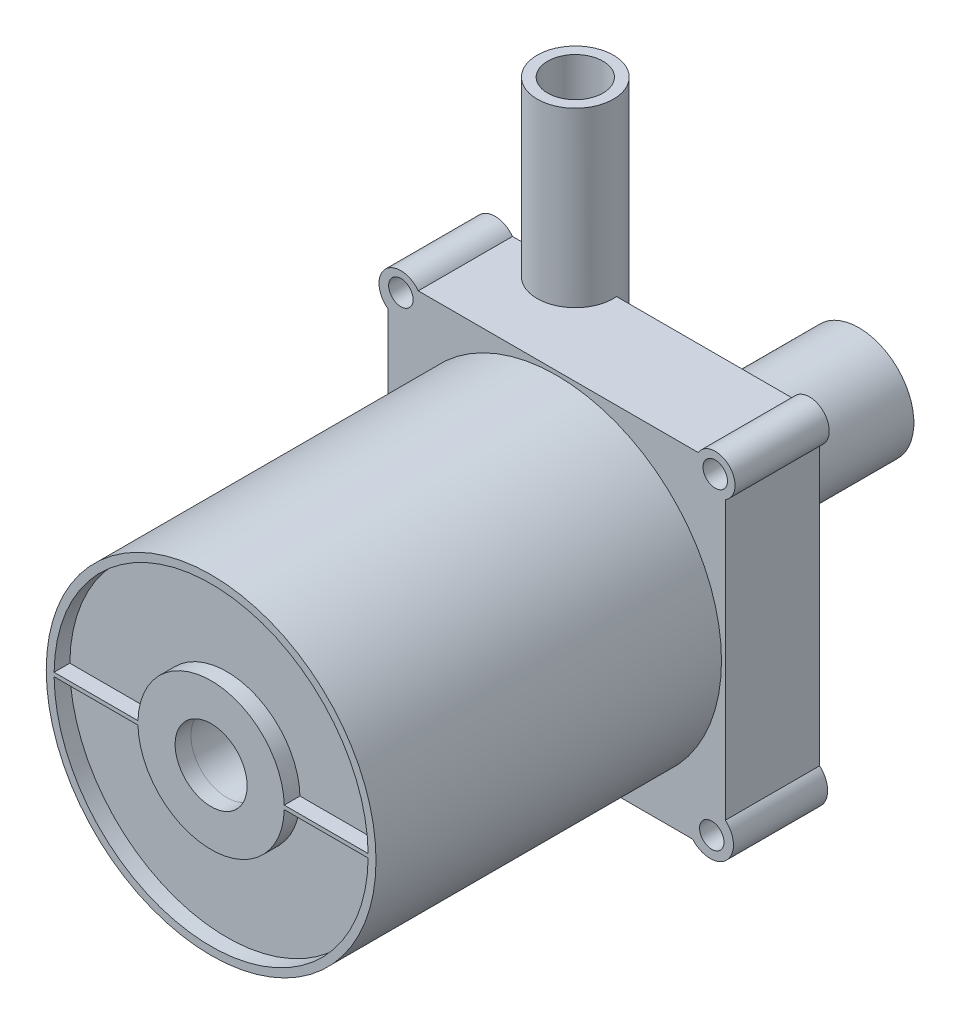
ISO-10303-21;
HEADER;
FILE_DESCRIPTION(('STEP AP214'),'2;1');
FILE_NAME('part.step','',(''),(''),'','','');
FILE_SCHEMA(('AUTOMOTIVE_DESIGN { 1 0 10303 214 1 1 1 1 }'));
ENDSEC;
DATA;
#1=APPLICATION_CONTEXT('core data for automotive mechanical design processes');
#2=APPLICATION_PROTOCOL_DEFINITION('international standard','automotive_design',2000,#1);
#3=PRODUCT_CONTEXT('',#1,'mechanical');
#4=PRODUCT('Part','Part','',(#3));
#5=PRODUCT_RELATED_PRODUCT_CATEGORY('part','',(#4));
#6=PRODUCT_DEFINITION_FORMATION('','',#4);
#7=PRODUCT_DEFINITION_CONTEXT('part definition',#1,'design');
#8=PRODUCT_DEFINITION('design','',#6,#7);
#9=PRODUCT_DEFINITION_SHAPE('','',#8);
#10=(LENGTH_UNIT() NAMED_UNIT(*) SI_UNIT(.MILLI.,.METRE.));
#11=(NAMED_UNIT(*) PLANE_ANGLE_UNIT() SI_UNIT($,.RADIAN.));
#12=(NAMED_UNIT(*) SI_UNIT($,.STERADIAN.) SOLID_ANGLE_UNIT());
#13=UNCERTAINTY_MEASURE_WITH_UNIT(LENGTH_MEASURE(1.E-05),#10,'distance_accuracy_value','');
#14=(GEOMETRIC_REPRESENTATION_CONTEXT(3) GLOBAL_UNCERTAINTY_ASSIGNED_CONTEXT((#13)) GLOBAL_UNIT_ASSIGNED_CONTEXT((#10,
#11,#12)) REPRESENTATION_CONTEXT('',''));
#15=CARTESIAN_POINT('',(0.,0.,0.));
#16=DIRECTION('',(0.,0.,1.));
#17=DIRECTION('',(1.,0.,0.));
#18=AXIS2_PLACEMENT_3D('',#15,#16,#17);
#19=CARTESIAN_POINT('',(-20.4985321115025,0.245318718606832,44.));
#20=DIRECTION('',(0.,-1.,0.));
#21=DIRECTION('',(0.,0.,-1.));
#22=AXIS2_PLACEMENT_3D('',#19,#20,#21);
#23=PLANE('',#22);
#24=DIRECTION('',(0.,0.,-1.));
#25=VECTOR('',#24,1.);
#26=CARTESIAN_POINT('',(-9.31614607403352,0.245318718606832,44.));
#27=LINE('',#26,#25);
#28=CARTESIAN_POINT('',(-9.31614607403352,0.245318718606832,42.));
#29=VERTEX_POINT('',#28);
#30=CARTESIAN_POINT('',(-9.31614607403352,0.245318718606832,44.));
#31=VERTEX_POINT('',#30);
#32=EDGE_CURVE('E315',#29,#31,#27,.F.);
#33=ORIENTED_EDGE('',*,*,#32,.F.);
#34=DIRECTION('',(-1.,0.,0.));
#35=VECTOR('',#34,1.);
#36=CARTESIAN_POINT('',(-20.4985321115025,0.245318718606832,42.));
#37=LINE('',#36,#35);
#38=CARTESIAN_POINT('',(-19.9984954115629,0.245318718606832,42.));
#39=VERTEX_POINT('',#38);
#40=EDGE_CURVE('E323',#29,#39,#37,.T.);
#41=ORIENTED_EDGE('',*,*,#40,.T.);
#42=DIRECTION('',(0.,0.,1.));
#43=VECTOR('',#42,1.);
#44=CARTESIAN_POINT('',(-19.9984954115629,0.245318718606832,42.));
#45=LINE('',#44,#43);
#46=CARTESIAN_POINT('',(-19.9984954115629,0.245318718606832,44.));
#47=VERTEX_POINT('',#46);
#48=EDGE_CURVE('E979',#39,#47,#45,.T.);
#49=ORIENTED_EDGE('',*,*,#48,.T.);
#50=DIRECTION('',(-1.,0.,0.));
#51=VECTOR('',#50,1.);
#52=CARTESIAN_POINT('',(-20.4985321115025,0.245318718606832,44.));
#53=LINE('',#52,#51);
#54=EDGE_CURVE('E985',#31,#47,#53,.T.);
#55=ORIENTED_EDGE('',*,*,#54,.F.);
#56=EDGE_LOOP('',(#33,#41,#49,#55));
#57=FACE_BOUND('',#56,.T.);
#58=ADVANCED_FACE('F184',(#57),#23,.F.);
#59=DIRECTION('',(0.,0.,-1.));
#60=VECTOR('',#59,1.);
#61=CARTESIAN_POINT('',(9.31614607403352,0.245318718606832,44.));
#62=LINE('',#61,#60);
#63=CARTESIAN_POINT('',(9.31614607403352,0.245318718606832,44.));
#64=VERTEX_POINT('',#63);
#65=CARTESIAN_POINT('',(9.31614607403352,0.245318718606832,42.));
#66=VERTEX_POINT('',#65);
#67=EDGE_CURVE('E307',#64,#66,#62,.T.);
#68=ORIENTED_EDGE('',*,*,#67,.F.);
#69=CARTESIAN_POINT('',(19.9984954115629,0.245318718606832,44.));
#70=VERTEX_POINT('',#69);
#71=EDGE_CURVE('E983',#70,#64,#53,.T.);
#72=ORIENTED_EDGE('',*,*,#71,.F.);
#73=DIRECTION('',(0.,0.,1.));
#74=VECTOR('',#73,1.);
#75=CARTESIAN_POINT('',(19.9984954115629,0.245318718606832,42.));
#76=LINE('',#75,#74);
#77=CARTESIAN_POINT('',(19.9984954115629,0.245318718606832,42.));
#78=VERTEX_POINT('',#77);
#79=EDGE_CURVE('E329',#70,#78,#76,.F.);
#80=ORIENTED_EDGE('',*,*,#79,.T.);
#81=EDGE_CURVE('E321',#78,#66,#37,.T.);
#82=ORIENTED_EDGE('',*,*,#81,.T.);
#83=EDGE_LOOP('',(#68,#72,#80,#82));
#84=FACE_BOUND('',#83,.T.);
#85=ADVANCED_FACE('F327',(#84),#23,.F.);
#86=CARTESIAN_POINT('',(-20.4985321115025,-0.245318718606832,44.));
#87=DIRECTION('',(0.,1.,0.));
#88=DIRECTION('',(0.,0.,1.));
#89=AXIS2_PLACEMENT_3D('',#86,#87,#88);
#90=PLANE('',#89);
#91=DIRECTION('',(0.,0.,-1.));
#92=VECTOR('',#91,1.);
#93=CARTESIAN_POINT('',(9.31614607403352,-0.245318718606832,44.));
#94=LINE('',#93,#92);
#95=CARTESIAN_POINT('',(9.31614607403352,-0.245318718606832,42.));
#96=VERTEX_POINT('',#95);
#97=CARTESIAN_POINT('',(9.31614607403351,-0.245318718606832,44.));
#98=VERTEX_POINT('',#97);
#99=EDGE_CURVE('E12',#96,#98,#94,.F.);
#100=ORIENTED_EDGE('',*,*,#99,.F.);
#101=DIRECTION('',(1.,0.,0.));
#102=VECTOR('',#101,1.);
#103=CARTESIAN_POINT('',(-20.4985321115025,-0.245318718606832,42.));
#104=LINE('',#103,#102);
#105=CARTESIAN_POINT('',(19.9984954115629,-0.245318718606832,42.));
#106=VERTEX_POINT('',#105);
#107=EDGE_CURVE('E330',#96,#106,#104,.T.);
#108=ORIENTED_EDGE('',*,*,#107,.T.);
#109=DIRECTION('',(0.,0.,1.));
#110=VECTOR('',#109,1.);
#111=CARTESIAN_POINT('',(19.9984954115629,-0.245318718606832,42.));
#112=LINE('',#111,#110);
#113=CARTESIAN_POINT('',(19.9984954115629,-0.245318718606832,44.));
#114=VERTEX_POINT('',#113);
#115=EDGE_CURVE('E362',#106,#114,#112,.T.);
#116=ORIENTED_EDGE('',*,*,#115,.T.);
#117=DIRECTION('',(1.,0.,0.));
#118=VECTOR('',#117,1.);
#119=CARTESIAN_POINT('',(-20.4985321115025,-0.245318718606832,44.));
#120=LINE('',#119,#118);
#121=EDGE_CURVE('E982',#98,#114,#120,.T.);
#122=ORIENTED_EDGE('',*,*,#121,.F.);
#123=EDGE_LOOP('',(#100,#108,#116,#122));
#124=FACE_BOUND('',#123,.T.);
#125=ADVANCED_FACE('F514',(#124),#90,.F.);
#126=DIRECTION('',(0.,0.,-1.));
#127=VECTOR('',#126,1.);
#128=CARTESIAN_POINT('',(-9.31614607403352,-0.245318718606832,44.));
#129=LINE('',#128,#127);
#130=CARTESIAN_POINT('',(-9.31614607403352,-0.245318718606832,44.));
#131=VERTEX_POINT('',#130);
#132=CARTESIAN_POINT('',(-9.31614607403352,-0.245318718606832,42.));
#133=VERTEX_POINT('',#132);
#134=EDGE_CURVE('E192',#131,#133,#129,.T.);
#135=ORIENTED_EDGE('',*,*,#134,.F.);
#136=CARTESIAN_POINT('',(-19.9984954115629,-0.245318718606832,44.));
#137=VERTEX_POINT('',#136);
#138=EDGE_CURVE('E335',#137,#131,#120,.T.);
#139=ORIENTED_EDGE('',*,*,#138,.F.);
#140=DIRECTION('',(0.,0.,1.));
#141=VECTOR('',#140,1.);
#142=CARTESIAN_POINT('',(-19.9984954115629,-0.245318718606832,42.));
#143=LINE('',#142,#141);
#144=CARTESIAN_POINT('',(-19.9984954115629,-0.245318718606832,42.));
#145=VERTEX_POINT('',#144);
#146=EDGE_CURVE('E973',#137,#145,#143,.F.);
#147=ORIENTED_EDGE('',*,*,#146,.T.);
#148=EDGE_CURVE('E332',#145,#133,#104,.T.);
#149=ORIENTED_EDGE('',*,*,#148,.T.);
#150=EDGE_LOOP('',(#135,#139,#147,#149));
#151=FACE_BOUND('',#150,.T.);
#152=ADVANCED_FACE('F521',(#151),#90,.F.);
#153=CARTESIAN_POINT('',(0.,0.,42.));
#154=DIRECTION('',(0.,0.,1.));
#155=DIRECTION('',(1.,0.,0.));
#156=AXIS2_PLACEMENT_3D('',#153,#154,#155);
#157=PLANE('',#156);
#158=ORIENTED_EDGE('',*,*,#40,.F.);
#159=CARTESIAN_POINT('',(0.,0.,42.));
#160=DIRECTION('',(0.,0.,1.));
#161=DIRECTION('',(1.,0.,0.));
#162=AXIS2_PLACEMENT_3D('',#159,#160,#161);
#163=CIRCLE('',#162,9.31937545903313);
#164=EDGE_CURVE('E310',#66,#29,#163,.T.);
#165=ORIENTED_EDGE('',*,*,#164,.F.);
#166=ORIENTED_EDGE('',*,*,#81,.F.);
#167=CARTESIAN_POINT('',(0.,0.,42.));
#168=DIRECTION('',(0.,0.,1.));
#169=DIRECTION('',(1.,0.,0.));
#170=AXIS2_PLACEMENT_3D('',#167,#168,#169);
#171=CIRCLE('',#170,20.);
#172=EDGE_CURVE('E338',#78,#39,#171,.T.);
#173=ORIENTED_EDGE('',*,*,#172,.T.);
#174=EDGE_LOOP('',(#158,#165,#166,#173));
#175=FACE_BOUND('',#174,.T.);
#176=ADVANCED_FACE('F319',(#175),#157,.T.);
#177=ORIENTED_EDGE('',*,*,#107,.F.);
#178=EDGE_CURVE('E324',#133,#96,#163,.T.);
#179=ORIENTED_EDGE('',*,*,#178,.F.);
#180=ORIENTED_EDGE('',*,*,#148,.F.);
#181=EDGE_CURVE('E341',#145,#106,#171,.T.);
#182=ORIENTED_EDGE('',*,*,#181,.T.);
#183=EDGE_LOOP('',(#177,#179,#180,#182));
#184=FACE_BOUND('',#183,.T.);
#185=ADVANCED_FACE('F520',(#184),#157,.T.);
#186=CARTESIAN_POINT('',(0.,0.,42.));
#187=DIRECTION('',(0.,0.,1.));
#188=DIRECTION('',(1.,0.,0.));
#189=AXIS2_PLACEMENT_3D('',#186,#187,#188);
#190=CYLINDRICAL_SURFACE('',#189,20.);
#191=ORIENTED_EDGE('',*,*,#79,.F.);
#192=CARTESIAN_POINT('',(0.,0.,44.));
#193=DIRECTION('',(0.,0.,1.));
#194=DIRECTION('',(1.,0.,0.));
#195=AXIS2_PLACEMENT_3D('',#192,#193,#194);
#196=CIRCLE('',#195,20.);
#197=EDGE_CURVE('E342',#70,#47,#196,.T.);
#198=ORIENTED_EDGE('',*,*,#197,.T.);
#199=ORIENTED_EDGE('',*,*,#48,.F.);
#200=ORIENTED_EDGE('',*,*,#172,.F.);
#201=EDGE_LOOP('',(#191,#198,#199,#200));
#202=FACE_BOUND('',#201,.T.);
#203=ADVANCED_FACE('F522',(#202),#190,.F.);
#204=ORIENTED_EDGE('',*,*,#146,.F.);
#205=EDGE_CURVE('E345',#137,#114,#196,.T.);
#206=ORIENTED_EDGE('',*,*,#205,.T.);
#207=ORIENTED_EDGE('',*,*,#115,.F.);
#208=ORIENTED_EDGE('',*,*,#181,.F.);
#209=EDGE_LOOP('',(#204,#206,#207,#208));
#210=FACE_BOUND('',#209,.T.);
#211=ADVANCED_FACE('F525',(#210),#190,.F.);
#212=CARTESIAN_POINT('',(0.,0.,81.5));
#213=DIRECTION('',(0.,0.,-1.));
#214=DIRECTION('',(-1.,0.,0.));
#215=AXIS2_PLACEMENT_3D('',#212,#213,#214);
#216=CYLINDRICAL_SURFACE('',#215,4.67050692238864);
#217=CARTESIAN_POINT('',(0.,0.,-38.5));
#218=DIRECTION('',(0.,0.,-1.));
#219=DIRECTION('',(-1.,0.,0.));
#220=AXIS2_PLACEMENT_3D('',#217,#218,#219);
#221=CIRCLE('',#220,4.67050692238864);
#222=CARTESIAN_POINT('',(-4.67050692238864,0.,-38.5));
#223=VERTEX_POINT('',#222);
#224=EDGE_CURVE('E349',#223,#223,#221,.T.);
#225=ORIENTED_EDGE('',*,*,#224,.T.);
#226=EDGE_LOOP('',(#225));
#227=FACE_BOUND('',#226,.T.);
#228=CARTESIAN_POINT('',(0.,0.,42.));
#229=DIRECTION('',(0.,0.,1.));
#230=DIRECTION('',(1.,0.,0.));
#231=AXIS2_PLACEMENT_3D('',#228,#229,#230);
#232=CIRCLE('',#231,4.67050692238864);
#233=CARTESIAN_POINT('',(4.67050692238864,0.,42.));
#234=VERTEX_POINT('',#233);
#235=EDGE_CURVE('E340',#234,#234,#232,.F.);
#236=ORIENTED_EDGE('',*,*,#235,.F.);
#237=EDGE_LOOP('',(#236));
#238=FACE_BOUND('',#237,.T.);
#239=ADVANCED_FACE('F537',(#227,#238),#216,.F.);
#240=CARTESIAN_POINT('',(0.,0.,44.));
#241=DIRECTION('',(0.,0.,-1.));
#242=DIRECTION('',(-1.,0.,0.));
#243=AXIS2_PLACEMENT_3D('',#240,#241,#242);
#244=CYLINDRICAL_SURFACE('',#243,21.);
#245=CARTESIAN_POINT('',(0.,0.,44.));
#246=DIRECTION('',(0.,0.,1.));
#247=DIRECTION('',(1.,0.,0.));
#248=AXIS2_PLACEMENT_3D('',#245,#246,#247);
#249=CIRCLE('',#248,21.);
#250=CARTESIAN_POINT('',(21.,0.,44.));
#251=VERTEX_POINT('',#250);
#252=EDGE_CURVE('E474',#251,#251,#249,.T.);
#253=ORIENTED_EDGE('',*,*,#252,.F.);
#254=EDGE_LOOP('',(#253));
#255=FACE_BOUND('',#254,.T.);
#256=CARTESIAN_POINT('',(0.,0.,0.));
#257=DIRECTION('',(0.,0.,1.));
#258=DIRECTION('',(1.,0.,0.));
#259=AXIS2_PLACEMENT_3D('',#256,#257,#258);
#260=CIRCLE('',#259,21.);
#261=CARTESIAN_POINT('',(21.,0.,0.));
#262=VERTEX_POINT('',#261);
#263=EDGE_CURVE('E472',#262,#262,#260,.T.);
#264=ORIENTED_EDGE('',*,*,#263,.T.);
#265=EDGE_LOOP('',(#264));
#266=FACE_BOUND('',#265,.T.);
#267=ADVANCED_FACE('F186',(#255,#266),#244,.T.);
#268=CARTESIAN_POINT('',(0.,0.,44.));
#269=DIRECTION('',(0.,0.,1.));
#270=DIRECTION('',(1.,0.,0.));
#271=AXIS2_PLACEMENT_3D('',#268,#269,#270);
#272=PLANE('',#271);
#273=CARTESIAN_POINT('',(0.,0.,44.));
#274=DIRECTION('',(0.,0.,1.));
#275=DIRECTION('',(1.,0.,0.));
#276=AXIS2_PLACEMENT_3D('',#273,#274,#275);
#277=CIRCLE('',#276,4.58231075628868);
#278=CARTESIAN_POINT('',(4.58231075628868,0.,44.));
#279=VERTEX_POINT('',#278);
#280=EDGE_CURVE('E989',#279,#279,#277,.T.);
#281=ORIENTED_EDGE('',*,*,#280,.F.);
#282=EDGE_LOOP('',(#281));
#283=FACE_BOUND('',#282,.T.);
#284=CARTESIAN_POINT('',(0.,0.,44.));
#285=DIRECTION('',(0.,0.,1.));
#286=DIRECTION('',(1.,0.,0.));
#287=AXIS2_PLACEMENT_3D('',#284,#285,#286);
#288=CIRCLE('',#287,9.31937545903313);
#289=EDGE_CURVE('E199',#64,#31,#288,.T.);
#290=ORIENTED_EDGE('',*,*,#289,.T.);
#291=ORIENTED_EDGE('',*,*,#54,.T.);
#292=ORIENTED_EDGE('',*,*,#197,.F.);
#293=ORIENTED_EDGE('',*,*,#71,.T.);
#294=EDGE_LOOP('',(#290,#291,#292,#293));
#295=FACE_BOUND('',#294,.T.);
#296=ORIENTED_EDGE('',*,*,#138,.T.);
#297=EDGE_CURVE('E207',#131,#98,#288,.T.);
#298=ORIENTED_EDGE('',*,*,#297,.T.);
#299=ORIENTED_EDGE('',*,*,#121,.T.);
#300=ORIENTED_EDGE('',*,*,#205,.F.);
#301=EDGE_LOOP('',(#296,#298,#299,#300));
#302=FACE_BOUND('',#301,.T.);
#303=ORIENTED_EDGE('',*,*,#252,.T.);
#304=EDGE_LOOP('',(#303));
#305=FACE_BOUND('',#304,.T.);
#306=ADVANCED_FACE('F658',(#283,#295,#302,#305),#272,.T.);
#307=CARTESIAN_POINT('',(0.,0.,0.));
#308=DIRECTION('',(0.,0.,-1.));
#309=DIRECTION('',(-1.,0.,0.));
#310=AXIS2_PLACEMENT_3D('',#307,#308,#309);
#311=PLANE('',#310);
#312=CARTESIAN_POINT('',(19.7620983400342,-19.8463660631883,0.));
#313=DIRECTION('',(0.,0.,-1.));
#314=DIRECTION('',(-1.,0.,0.));
#315=AXIS2_PLACEMENT_3D('',#312,#313,#314);
#316=CIRCLE('',#315,1.5579999493852);
#317=CARTESIAN_POINT('',(18.204098390649,-19.8463660631883,0.));
#318=VERTEX_POINT('',#317);
#319=EDGE_CURVE('E398',#318,#318,#316,.T.);
#320=ORIENTED_EDGE('',*,*,#319,.T.);
#321=EDGE_LOOP('',(#320));
#322=FACE_BOUND('',#321,.T.);
#323=CARTESIAN_POINT('',(-19.8463660631883,-19.8463660631883,0.));
#324=DIRECTION('',(0.,0.,-1.));
#325=DIRECTION('',(-1.,0.,0.));
#326=AXIS2_PLACEMENT_3D('',#323,#324,#325);
#327=CIRCLE('',#326,1.5579999493852);
#328=CARTESIAN_POINT('',(-21.4043660125735,-19.8463660631883,0.));
#329=VERTEX_POINT('',#328);
#330=EDGE_CURVE('E392',#329,#329,#327,.T.);
#331=ORIENTED_EDGE('',*,*,#330,.T.);
#332=EDGE_LOOP('',(#331));
#333=FACE_BOUND('',#332,.T.);
#334=CARTESIAN_POINT('',(-19.8325900288241,20.2020357058978,0.));
#335=DIRECTION('',(0.,0.,-1.));
#336=DIRECTION('',(-1.,0.,0.));
#337=AXIS2_PLACEMENT_3D('',#334,#335,#336);
#338=CIRCLE('',#337,1.5579999493852);
#339=CARTESIAN_POINT('',(-21.3905899782093,20.2020357058978,0.));
#340=VERTEX_POINT('',#339);
#341=EDGE_CURVE('E385',#340,#340,#338,.T.);
#342=ORIENTED_EDGE('',*,*,#341,.T.);
#343=EDGE_LOOP('',(#342));
#344=FACE_BOUND('',#343,.T.);
#345=CARTESIAN_POINT('',(20.2020357058978,20.2020357058978,0.));
#346=DIRECTION('',(0.,0.,-1.));
#347=DIRECTION('',(-1.,0.,0.));
#348=AXIS2_PLACEMENT_3D('',#345,#346,#347);
#349=CIRCLE('',#348,1.5579999493852);
#350=CARTESIAN_POINT('',(18.6440357565126,20.2020357058978,0.));
#351=VERTEX_POINT('',#350);
#352=EDGE_CURVE('E403',#351,#351,#349,.T.);
#353=ORIENTED_EDGE('',*,*,#352,.T.);
#354=EDGE_LOOP('',(#353));
#355=FACE_BOUND('',#354,.T.);
#356=ORIENTED_EDGE('',*,*,#263,.F.);
#357=EDGE_LOOP('',(#356));
#358=FACE_BOUND('',#357,.T.);
#359=CARTESIAN_POINT('',(-19.8463660631883,19.8463660631883,0.));
#360=DIRECTION('',(0.,0.,-1.));
#361=DIRECTION('',(-1.,0.,0.));
#362=AXIS2_PLACEMENT_3D('',#359,#360,#361);
#363=CIRCLE('',#362,2.77422321313372);
#364=CARTESIAN_POINT('',(-21.5,17.6188541688734,0.));
#365=VERTEX_POINT('',#364);
#366=CARTESIAN_POINT('',(-17.6188541688733,21.5,0.));
#367=VERTEX_POINT('',#366);
#368=EDGE_CURVE('E462',#365,#367,#363,.T.);
#369=ORIENTED_EDGE('',*,*,#368,.F.);
#370=DIRECTION('',(0.,-1.,0.));
#371=VECTOR('',#370,1.);
#372=CARTESIAN_POINT('',(-21.5,0.,0.));
#373=LINE('',#372,#371);
#374=CARTESIAN_POINT('',(-21.5,-17.2144107071384,0.));
#375=VERTEX_POINT('',#374);
#376=EDGE_CURVE('E434',#365,#375,#373,.T.);
#377=ORIENTED_EDGE('',*,*,#376,.T.);
#378=CARTESIAN_POINT('',(-19.8463660631883,-19.8463660631883,0.));
#379=DIRECTION('',(0.,0.,-1.));
#380=DIRECTION('',(-1.,0.,0.));
#381=AXIS2_PLACEMENT_3D('',#378,#379,#380);
#382=CIRCLE('',#381,3.10832659050096);
#383=CARTESIAN_POINT('',(-17.2144107071384,-21.5,0.));
#384=VERTEX_POINT('',#383);
#385=EDGE_CURVE('E430',#384,#375,#382,.T.);
#386=ORIENTED_EDGE('',*,*,#385,.F.);
#387=DIRECTION('',(-1.,0.,0.));
#388=VECTOR('',#387,1.);
#389=CARTESIAN_POINT('',(0.,-21.5,0.));
#390=LINE('',#389,#388);
#391=CARTESIAN_POINT('',(17.3263526997513,-21.5,0.));
#392=VERTEX_POINT('',#391);
#393=EDGE_CURVE('E427',#392,#384,#390,.T.);
#394=ORIENTED_EDGE('',*,*,#393,.F.);
#395=CARTESIAN_POINT('',(19.5618303490206,-19.5618303490206,0.));
#396=DIRECTION('',(0.,0.,-1.));
#397=DIRECTION('',(-1.,0.,0.));
#398=AXIS2_PLACEMENT_3D('',#395,#396,#397);
#399=CIRCLE('',#398,2.95869260254596);
#400=CARTESIAN_POINT('',(21.5,-17.3263526997513,0.));
#401=VERTEX_POINT('',#400);
#402=EDGE_CURVE('E406',#401,#392,#399,.T.);
#403=ORIENTED_EDGE('',*,*,#402,.F.);
#404=DIRECTION('',(0.,-1.,0.));
#405=VECTOR('',#404,1.);
#406=CARTESIAN_POINT('',(21.5,0.,0.));
#407=LINE('',#406,#405);
#408=CARTESIAN_POINT('',(21.5,18.0408569434563,0.));
#409=VERTEX_POINT('',#408);
#410=EDGE_CURVE('E413',#409,#401,#407,.T.);
#411=ORIENTED_EDGE('',*,*,#410,.F.);
#412=CARTESIAN_POINT('',(20.2020357058978,20.2020357058978,0.));
#413=DIRECTION('',(0.,0.,-1.));
#414=DIRECTION('',(-1.,0.,0.));
#415=AXIS2_PLACEMENT_3D('',#412,#413,#414);
#416=CIRCLE('',#415,2.52099285044455);
#417=CARTESIAN_POINT('',(18.0408569434563,21.5,0.));
#418=VERTEX_POINT('',#417);
#419=EDGE_CURVE('E456',#418,#409,#416,.T.);
#420=ORIENTED_EDGE('',*,*,#419,.F.);
#421=DIRECTION('',(-1.,0.,0.));
#422=VECTOR('',#421,1.);
#423=CARTESIAN_POINT('',(0.,21.5,0.));
#424=LINE('',#423,#422);
#425=EDGE_CURVE('E437',#418,#367,#424,.T.);
#426=ORIENTED_EDGE('',*,*,#425,.T.);
#427=EDGE_LOOP('',(#369,#377,#386,#394,#403,#411,#420,#426));
#428=FACE_BOUND('',#427,.T.);
#429=ADVANCED_FACE('F663',(#322,#333,#344,#355,#358,#428),#311,.F.);
#430=CARTESIAN_POINT('',(0.,-21.5,-12.));
#431=DIRECTION('',(0.,1.,0.));
#432=DIRECTION('',(0.,0.,1.));
#433=AXIS2_PLACEMENT_3D('',#430,#431,#432);
#434=PLANE('',#433);
#435=DIRECTION('',(0.,0.,1.));
#436=VECTOR('',#435,1.);
#437=CARTESIAN_POINT('',(17.3263526997513,-21.5,-12.));
#438=LINE('',#437,#436);
#439=CARTESIAN_POINT('',(17.3263526997513,-21.5,-12.));
#440=VERTEX_POINT('',#439);
#441=EDGE_CURVE('E470',#392,#440,#438,.F.);
#442=ORIENTED_EDGE('',*,*,#441,.F.);
#443=ORIENTED_EDGE('',*,*,#393,.T.);
#444=DIRECTION('',(0.,0.,1.));
#445=VECTOR('',#444,1.);
#446=CARTESIAN_POINT('',(-17.2144107071384,-21.5,-12.));
#447=LINE('',#446,#445);
#448=CARTESIAN_POINT('',(-17.2144107071384,-21.5,-12.));
#449=VERTEX_POINT('',#448);
#450=EDGE_CURVE('E451',#449,#384,#447,.T.);
#451=ORIENTED_EDGE('',*,*,#450,.F.);
#452=DIRECTION('',(-1.,0.,0.));
#453=VECTOR('',#452,1.);
#454=CARTESIAN_POINT('',(0.,-21.5,-12.));
#455=LINE('',#454,#453);
#456=EDGE_CURVE('E409',#440,#449,#455,.T.);
#457=ORIENTED_EDGE('',*,*,#456,.F.);
#458=EDGE_LOOP('',(#442,#443,#451,#457));
#459=FACE_BOUND('',#458,.T.);
#460=ADVANCED_FACE('F727',(#459),#434,.F.);
#461=CARTESIAN_POINT('',(-21.5,0.,-12.));
#462=DIRECTION('',(-1.,0.,0.));
#463=DIRECTION('',(0.,-1.,0.));
#464=AXIS2_PLACEMENT_3D('',#461,#462,#463);
#465=PLANE('',#464);
#466=ORIENTED_EDGE('',*,*,#376,.F.);
#467=DIRECTION('',(0.,0.,1.));
#468=VECTOR('',#467,1.);
#469=CARTESIAN_POINT('',(-21.5,17.6188541688734,-12.));
#470=LINE('',#469,#468);
#471=CARTESIAN_POINT('',(-21.5,17.6188541688734,-12.));
#472=VERTEX_POINT('',#471);
#473=EDGE_CURVE('E447',#472,#365,#470,.T.);
#474=ORIENTED_EDGE('',*,*,#473,.F.);
#475=DIRECTION('',(0.,-1.,0.));
#476=VECTOR('',#475,1.);
#477=CARTESIAN_POINT('',(-21.5,0.,-12.));
#478=LINE('',#477,#476);
#479=CARTESIAN_POINT('',(-21.5,-17.2144107071384,-12.));
#480=VERTEX_POINT('',#479);
#481=EDGE_CURVE('E416',#472,#480,#478,.T.);
#482=ORIENTED_EDGE('',*,*,#481,.T.);
#483=DIRECTION('',(0.,0.,1.));
#484=VECTOR('',#483,1.);
#485=CARTESIAN_POINT('',(-21.5,-17.2144107071384,-12.));
#486=LINE('',#485,#484);
#487=EDGE_CURVE('E449',#480,#375,#486,.T.);
#488=ORIENTED_EDGE('',*,*,#487,.T.);
#489=EDGE_LOOP('',(#466,#474,#482,#488));
#490=FACE_BOUND('',#489,.T.);
#491=ADVANCED_FACE('F737',(#490),#465,.T.);
#492=CARTESIAN_POINT('',(0.,21.5,-12.));
#493=DIRECTION('',(0.,1.,0.));
#494=DIRECTION('',(0.,0.,1.));
#495=AXIS2_PLACEMENT_3D('',#492,#493,#494);
#496=PLANE('',#495);
#497=CARTESIAN_POINT('',(-9.19265572877705,21.5,-11.5735868923609));
#498=DIRECTION('',(0.,1.,0.));
#499=DIRECTION('',(0.,0.,1.));
#500=AXIS2_PLACEMENT_3D('',#497,#498,#499);
#501=CIRCLE('',#500,4.85603157215035);
#502=CARTESIAN_POINT('',(-14.0299291851112,21.5,-12.));
#503=VERTEX_POINT('',#502);
#504=CARTESIAN_POINT('',(-4.35538227244294,21.5,-12.));
#505=VERTEX_POINT('',#504);
#506=EDGE_CURVE('E376',#503,#505,#501,.T.);
#507=ORIENTED_EDGE('',*,*,#506,.F.);
#508=DIRECTION('',(-1.,0.,0.));
#509=VECTOR('',#508,1.);
#510=CARTESIAN_POINT('',(0.,21.5,-12.));
#511=LINE('',#510,#509);
#512=CARTESIAN_POINT('',(-17.6188541688733,21.5,-12.));
#513=VERTEX_POINT('',#512);
#514=EDGE_CURVE('E419',#503,#513,#511,.T.);
#515=ORIENTED_EDGE('',*,*,#514,.T.);
#516=DIRECTION('',(0.,0.,1.));
#517=VECTOR('',#516,1.);
#518=CARTESIAN_POINT('',(-17.6188541688733,21.5,-12.));
#519=LINE('',#518,#517);
#520=EDGE_CURVE('E445',#513,#367,#519,.T.);
#521=ORIENTED_EDGE('',*,*,#520,.T.);
#522=ORIENTED_EDGE('',*,*,#425,.F.);
#523=DIRECTION('',(0.,0.,1.));
#524=VECTOR('',#523,1.);
#525=CARTESIAN_POINT('',(18.0408569434563,21.5,-12.));
#526=LINE('',#525,#524);
#527=CARTESIAN_POINT('',(18.0408569434563,21.5,-12.));
#528=VERTEX_POINT('',#527);
#529=EDGE_CURVE('E443',#528,#418,#526,.T.);
#530=ORIENTED_EDGE('',*,*,#529,.F.);
#531=EDGE_CURVE('E420',#528,#505,#511,.T.);
#532=ORIENTED_EDGE('',*,*,#531,.T.);
#533=EDGE_LOOP('',(#507,#515,#521,#522,#530,#532));
#534=FACE_BOUND('',#533,.T.);
#535=ADVANCED_FACE('F746',(#534),#496,.T.);
#536=CARTESIAN_POINT('',(21.5,0.,-12.));
#537=DIRECTION('',(-1.,0.,0.));
#538=DIRECTION('',(0.,-1.,0.));
#539=AXIS2_PLACEMENT_3D('',#536,#537,#538);
#540=PLANE('',#539);
#541=DIRECTION('',(0.,0.,1.));
#542=VECTOR('',#541,1.);
#543=CARTESIAN_POINT('',(21.5,-17.3263526997513,-12.));
#544=LINE('',#543,#542);
#545=CARTESIAN_POINT('',(21.5,-17.3263526997513,-12.));
#546=VERTEX_POINT('',#545);
#547=EDGE_CURVE('E453',#546,#401,#544,.T.);
#548=ORIENTED_EDGE('',*,*,#547,.F.);
#549=DIRECTION('',(0.,-1.,0.));
#550=VECTOR('',#549,1.);
#551=CARTESIAN_POINT('',(21.5,0.,-12.));
#552=LINE('',#551,#550);
#553=CARTESIAN_POINT('',(21.5,18.0408569434563,-12.));
#554=VERTEX_POINT('',#553);
#555=EDGE_CURVE('E423',#554,#546,#552,.T.);
#556=ORIENTED_EDGE('',*,*,#555,.F.);
#557=DIRECTION('',(0.,0.,1.));
#558=VECTOR('',#557,1.);
#559=CARTESIAN_POINT('',(21.5,18.0408569434563,-12.));
#560=LINE('',#559,#558);
#561=EDGE_CURVE('E426',#554,#409,#560,.T.);
#562=ORIENTED_EDGE('',*,*,#561,.T.);
#563=ORIENTED_EDGE('',*,*,#410,.T.);
#564=EDGE_LOOP('',(#548,#556,#562,#563));
#565=FACE_BOUND('',#564,.T.);
#566=ADVANCED_FACE('F756',(#565),#540,.F.);
#567=CARTESIAN_POINT('',(-19.8463660631883,-19.8463660631883,-12.));
#568=DIRECTION('',(0.,0.,1.));
#569=DIRECTION('',(1.,0.,0.));
#570=AXIS2_PLACEMENT_3D('',#567,#568,#569);
#571=CYLINDRICAL_SURFACE('',#570,3.10832659050096);
#572=ORIENTED_EDGE('',*,*,#385,.T.);
#573=ORIENTED_EDGE('',*,*,#487,.F.);
#574=CARTESIAN_POINT('',(-19.8463660631883,-19.8463660631883,-12.));
#575=DIRECTION('',(0.,0.,-1.));
#576=DIRECTION('',(-1.,0.,0.));
#577=AXIS2_PLACEMENT_3D('',#574,#575,#576);
#578=CIRCLE('',#577,3.10832659050096);
#579=EDGE_CURVE('E412',#449,#480,#578,.T.);
#580=ORIENTED_EDGE('',*,*,#579,.F.);
#581=ORIENTED_EDGE('',*,*,#450,.T.);
#582=EDGE_LOOP('',(#572,#573,#580,#581));
#583=FACE_BOUND('',#582,.T.);
#584=ADVANCED_FACE('F730',(#583),#571,.T.);
#585=CARTESIAN_POINT('',(0.,0.,-12.));
#586=DIRECTION('',(0.,0.,-1.));
#587=DIRECTION('',(-1.,0.,0.));
#588=AXIS2_PLACEMENT_3D('',#585,#586,#587);
#589=PLANE('',#588);
#590=DIRECTION('',(0.,1.,0.));
#591=VECTOR('',#590,1.);
#592=CARTESIAN_POINT('',(-14.0299291851112,-0.5,-12.));
#593=LINE('',#592,#591);
#594=CARTESIAN_POINT('',(-14.0299291851112,2.49471181918195,-12.));
#595=VERTEX_POINT('',#594);
#596=EDGE_CURVE('E374',#595,#503,#593,.T.);
#597=ORIENTED_EDGE('',*,*,#596,.F.);
#598=CARTESIAN_POINT('',(0.,0.,-12.));
#599=DIRECTION('',(0.,0.,-1.));
#600=DIRECTION('',(-1.,0.,0.));
#601=AXIS2_PLACEMENT_3D('',#598,#599,#600);
#602=CIRCLE('',#601,14.25);
#603=CARTESIAN_POINT('',(-4.35538227244294,13.5680929117135,-12.));
#604=VERTEX_POINT('',#603);
#605=EDGE_CURVE('E378',#604,#595,#602,.T.);
#606=ORIENTED_EDGE('',*,*,#605,.F.);
#607=DIRECTION('',(0.,1.,0.));
#608=VECTOR('',#607,1.);
#609=CARTESIAN_POINT('',(-4.35538227244294,-0.5,-12.));
#610=LINE('',#609,#608);
#611=EDGE_CURVE('E372',#505,#604,#610,.F.);
#612=ORIENTED_EDGE('',*,*,#611,.F.);
#613=ORIENTED_EDGE('',*,*,#531,.F.);
#614=CARTESIAN_POINT('',(20.2020357058978,20.2020357058978,-12.));
#615=DIRECTION('',(0.,0.,-1.));
#616=DIRECTION('',(-1.,0.,0.));
#617=AXIS2_PLACEMENT_3D('',#614,#615,#616);
#618=CIRCLE('',#617,2.52099285044455);
#619=EDGE_CURVE('E431',#528,#554,#618,.T.);
#620=ORIENTED_EDGE('',*,*,#619,.T.);
#621=ORIENTED_EDGE('',*,*,#555,.T.);
#622=CARTESIAN_POINT('',(19.5618303490206,-19.5618303490206,-12.));
#623=DIRECTION('',(0.,0.,-1.));
#624=DIRECTION('',(-1.,0.,0.));
#625=AXIS2_PLACEMENT_3D('',#622,#623,#624);
#626=CIRCLE('',#625,2.95869260254596);
#627=EDGE_CURVE('E465',#546,#440,#626,.T.);
#628=ORIENTED_EDGE('',*,*,#627,.T.);
#629=ORIENTED_EDGE('',*,*,#456,.T.);
#630=ORIENTED_EDGE('',*,*,#579,.T.);
#631=ORIENTED_EDGE('',*,*,#481,.F.);
#632=CARTESIAN_POINT('',(-19.8463660631883,19.8463660631883,-12.));
#633=DIRECTION('',(0.,0.,-1.));
#634=DIRECTION('',(-1.,0.,0.));
#635=AXIS2_PLACEMENT_3D('',#632,#633,#634);
#636=CIRCLE('',#635,2.77422321313372);
#637=EDGE_CURVE('E459',#472,#513,#636,.T.);
#638=ORIENTED_EDGE('',*,*,#637,.T.);
#639=ORIENTED_EDGE('',*,*,#514,.F.);
#640=EDGE_LOOP('',(#597,#606,#612,#613,#620,#621,#628,#629,#630,#631,#638,#639));
#641=FACE_BOUND('',#640,.T.);
#642=CARTESIAN_POINT('',(19.7620983400342,-19.8463660631883,-12.));
#643=DIRECTION('',(0.,0.,-1.));
#644=DIRECTION('',(-1.,0.,0.));
#645=AXIS2_PLACEMENT_3D('',#642,#643,#644);
#646=CIRCLE('',#645,1.5579999493852);
#647=CARTESIAN_POINT('',(18.204098390649,-19.8463660631883,-12.));
#648=VERTEX_POINT('',#647);
#649=EDGE_CURVE('E382',#648,#648,#646,.T.);
#650=ORIENTED_EDGE('',*,*,#649,.F.);
#651=EDGE_LOOP('',(#650));
#652=FACE_BOUND('',#651,.T.);
#653=CARTESIAN_POINT('',(-19.8463660631883,-19.8463660631883,-12.));
#654=DIRECTION('',(0.,0.,-1.));
#655=DIRECTION('',(-1.,0.,0.));
#656=AXIS2_PLACEMENT_3D('',#653,#654,#655);
#657=CIRCLE('',#656,1.5579999493852);
#658=CARTESIAN_POINT('',(-21.4043660125735,-19.8463660631883,-12.));
#659=VERTEX_POINT('',#658);
#660=EDGE_CURVE('E395',#659,#659,#657,.T.);
#661=ORIENTED_EDGE('',*,*,#660,.F.);
#662=EDGE_LOOP('',(#661));
#663=FACE_BOUND('',#662,.T.);
#664=CARTESIAN_POINT('',(-19.8325900288241,20.2020357058978,-12.));
#665=DIRECTION('',(0.,0.,-1.));
#666=DIRECTION('',(-1.,0.,0.));
#667=AXIS2_PLACEMENT_3D('',#664,#665,#666);
#668=CIRCLE('',#667,1.5579999493852);
#669=CARTESIAN_POINT('',(-21.3905899782093,20.2020357058978,-12.));
#670=VERTEX_POINT('',#669);
#671=EDGE_CURVE('E389',#670,#670,#668,.T.);
#672=ORIENTED_EDGE('',*,*,#671,.F.);
#673=EDGE_LOOP('',(#672));
#674=FACE_BOUND('',#673,.T.);
#675=CARTESIAN_POINT('',(20.2020357058978,20.2020357058978,-12.));
#676=DIRECTION('',(0.,0.,-1.));
#677=DIRECTION('',(-1.,0.,0.));
#678=AXIS2_PLACEMENT_3D('',#675,#676,#677);
#679=CIRCLE('',#678,1.5579999493852);
#680=CARTESIAN_POINT('',(18.6440357565126,20.2020357058978,-12.));
#681=VERTEX_POINT('',#680);
#682=EDGE_CURVE('E388',#681,#681,#679,.T.);
#683=ORIENTED_EDGE('',*,*,#682,.F.);
#684=EDGE_LOOP('',(#683));
#685=FACE_BOUND('',#684,.T.);
#686=ADVANCED_FACE('F740',(#641,#652,#663,#674,#685),#589,.T.);
#687=CARTESIAN_POINT('',(-19.8463660631883,19.8463660631883,-12.));
#688=DIRECTION('',(0.,0.,1.));
#689=DIRECTION('',(1.,0.,0.));
#690=AXIS2_PLACEMENT_3D('',#687,#688,#689);
#691=CYLINDRICAL_SURFACE('',#690,2.77422321313372);
#692=ORIENTED_EDGE('',*,*,#473,.T.);
#693=ORIENTED_EDGE('',*,*,#368,.T.);
#694=ORIENTED_EDGE('',*,*,#520,.F.);
#695=ORIENTED_EDGE('',*,*,#637,.F.);
#696=EDGE_LOOP('',(#692,#693,#694,#695));
#697=FACE_BOUND('',#696,.T.);
#698=ADVANCED_FACE('F749',(#697),#691,.T.);
#699=CARTESIAN_POINT('',(20.2020357058978,20.2020357058978,-12.));
#700=DIRECTION('',(0.,0.,1.));
#701=DIRECTION('',(1.,0.,0.));
#702=AXIS2_PLACEMENT_3D('',#699,#700,#701);
#703=CYLINDRICAL_SURFACE('',#702,2.52099285044455);
#704=ORIENTED_EDGE('',*,*,#561,.F.);
#705=ORIENTED_EDGE('',*,*,#619,.F.);
#706=ORIENTED_EDGE('',*,*,#529,.T.);
#707=ORIENTED_EDGE('',*,*,#419,.T.);
#708=EDGE_LOOP('',(#704,#705,#706,#707));
#709=FACE_BOUND('',#708,.T.);
#710=ADVANCED_FACE('F759',(#709),#703,.T.);
#711=CARTESIAN_POINT('',(19.5618303490206,-19.5618303490206,-12.));
#712=DIRECTION('',(0.,0.,1.));
#713=DIRECTION('',(1.,0.,0.));
#714=AXIS2_PLACEMENT_3D('',#711,#712,#713);
#715=CYLINDRICAL_SURFACE('',#714,2.95869260254596);
#716=ORIENTED_EDGE('',*,*,#627,.F.);
#717=ORIENTED_EDGE('',*,*,#547,.T.);
#718=ORIENTED_EDGE('',*,*,#402,.T.);
#719=ORIENTED_EDGE('',*,*,#441,.T.);
#720=EDGE_LOOP('',(#716,#717,#718,#719));
#721=FACE_BOUND('',#720,.T.);
#722=ADVANCED_FACE('F767',(#721),#715,.T.);
#723=CARTESIAN_POINT('',(20.2020357058978,20.2020357058978,0.));
#724=DIRECTION('',(0.,0.,-1.));
#725=DIRECTION('',(-1.,0.,0.));
#726=AXIS2_PLACEMENT_3D('',#723,#724,#725);
#727=CYLINDRICAL_SURFACE('',#726,1.5579999493852);
#728=ORIENTED_EDGE('',*,*,#352,.F.);
#729=EDGE_LOOP('',(#728));
#730=FACE_BOUND('',#729,.T.);
#731=ORIENTED_EDGE('',*,*,#682,.T.);
#732=EDGE_LOOP('',(#731));
#733=FACE_BOUND('',#732,.T.);
#734=ADVANCED_FACE('F799',(#730,#733),#727,.F.);
#735=CARTESIAN_POINT('',(-19.8325900288241,20.2020357058978,0.));
#736=DIRECTION('',(0.,0.,-1.));
#737=DIRECTION('',(-1.,0.,0.));
#738=AXIS2_PLACEMENT_3D('',#735,#736,#737);
#739=CYLINDRICAL_SURFACE('',#738,1.5579999493852);
#740=ORIENTED_EDGE('',*,*,#341,.F.);
#741=EDGE_LOOP('',(#740));
#742=FACE_BOUND('',#741,.T.);
#743=ORIENTED_EDGE('',*,*,#671,.T.);
#744=EDGE_LOOP('',(#743));
#745=FACE_BOUND('',#744,.T.);
#746=ADVANCED_FACE('F806',(#742,#745),#739,.F.);
#747=CARTESIAN_POINT('',(-19.8463660631883,-19.8463660631883,0.));
#748=DIRECTION('',(0.,0.,-1.));
#749=DIRECTION('',(-1.,0.,0.));
#750=AXIS2_PLACEMENT_3D('',#747,#748,#749);
#751=CYLINDRICAL_SURFACE('',#750,1.5579999493852);
#752=ORIENTED_EDGE('',*,*,#330,.F.);
#753=EDGE_LOOP('',(#752));
#754=FACE_BOUND('',#753,.T.);
#755=ORIENTED_EDGE('',*,*,#660,.T.);
#756=EDGE_LOOP('',(#755));
#757=FACE_BOUND('',#756,.T.);
#758=ADVANCED_FACE('F814',(#754,#757),#751,.F.);
#759=CARTESIAN_POINT('',(19.7620983400342,-19.8463660631883,0.));
#760=DIRECTION('',(0.,0.,-1.));
#761=DIRECTION('',(-1.,0.,0.));
#762=AXIS2_PLACEMENT_3D('',#759,#760,#761);
#763=CYLINDRICAL_SURFACE('',#762,1.5579999493852);
#764=ORIENTED_EDGE('',*,*,#319,.F.);
#765=EDGE_LOOP('',(#764));
#766=FACE_BOUND('',#765,.T.);
#767=ORIENTED_EDGE('',*,*,#649,.T.);
#768=EDGE_LOOP('',(#767));
#769=FACE_BOUND('',#768,.T.);
#770=ADVANCED_FACE('F504',(#766,#769),#763,.F.);
#771=CARTESIAN_POINT('',(0.,0.,-16.5));
#772=DIRECTION('',(0.,0.,1.));
#773=DIRECTION('',(1.,0.,0.));
#774=AXIS2_PLACEMENT_3D('',#771,#772,#773);
#775=CYLINDRICAL_SURFACE('',#774,14.25);
#776=CARTESIAN_POINT('',(0.,0.,-16.5));
#777=DIRECTION('',(0.,0.,-1.));
#778=DIRECTION('',(-1.,0.,0.));
#779=AXIS2_PLACEMENT_3D('',#776,#777,#778);
#780=CIRCLE('',#779,14.25);
#781=CARTESIAN_POINT('',(-14.25,0.,-16.5));
#782=VERTEX_POINT('',#781);
#783=EDGE_CURVE('E379',#782,#782,#780,.T.);
#784=ORIENTED_EDGE('',*,*,#783,.F.);
#785=EDGE_LOOP('',(#784));
#786=FACE_BOUND('',#785,.T.);
#787=ORIENTED_EDGE('',*,*,#605,.T.);
#788=CARTESIAN_POINT('',(-14.0299291851112,2.49471181918195,-12.));
#789=CARTESIAN_POINT('',(-14.0267807930841,2.51242293626871,-12.0356876657495));
#790=CARTESIAN_POINT('',(-14.0233164666596,2.53170640712892,-12.0705037953848));
#791=CARTESIAN_POINT('',(-14.0158399477412,2.57277276747722,-12.1384835666401));
#792=CARTESIAN_POINT('',(-14.0118288357477,2.59455071441231,-12.1716502954906));
#793=CARTESIAN_POINT('',(-13.9991368099467,2.66247448197401,-12.2685835835201));
#794=CARTESIAN_POINT('',(-13.9897534151015,2.71146108195267,-12.3302517060568));
#795=CARTESIAN_POINT('',(-13.9695847120862,2.81351959849811,-12.448542257745));
#796=CARTESIAN_POINT('',(-13.9588158611729,2.86654096751572,-12.5052124998782));
#797=CARTESIAN_POINT('',(-13.9359516385837,2.97571426282434,-12.6153888316772));
#798=CARTESIAN_POINT('',(-13.9238534403074,3.03187272994134,-12.6688877915825));
#799=CARTESIAN_POINT('',(-13.8898915713288,3.18480871676778,-12.8085532766664));
#800=CARTESIAN_POINT('',(-13.8669448474772,3.28343619596803,-12.8924166398853));
#801=CARTESIAN_POINT('',(-13.8179255310783,3.48398223119579,-13.0551811061966));
#802=CARTESIAN_POINT('',(-13.7918511445949,3.58590265123667,-13.1340793214912));
#803=CARTESIAN_POINT('',(-13.7366689474825,3.7918057695174,-13.2881374224936));
#804=CARTESIAN_POINT('',(-13.7075595618472,3.89578951562533,-13.3632953369932));
#805=CARTESIAN_POINT('',(-13.6463594248481,4.1050301974876,-13.5105726287576));
#806=CARTESIAN_POINT('',(-13.6142682816575,4.21028729898578,-13.5826916048665));
#807=CARTESIAN_POINT('',(-13.5123911536596,4.53084694404714,-13.79764179487));
#808=CARTESIAN_POINT('',(-13.4379448395805,4.74737882080706,-13.9364674377251));
#809=CARTESIAN_POINT('',(-13.2767521642255,5.1811137086335,-14.2052540772825));
#810=CARTESIAN_POINT('',(-13.1900129608288,5.39831625768955,-14.3352201679411));
#811=CARTESIAN_POINT('',(-12.9697138188261,5.91213135708788,-14.6331203511959));
#812=CARTESIAN_POINT('',(-12.8306737490233,6.20853661866724,-14.7974148616264));
#813=CARTESIAN_POINT('',(-12.5283333255815,6.79802942629064,-15.1093254710687));
#814=CARTESIAN_POINT('',(-12.3650192895031,7.09111500021014,-15.2569320805028));
#815=CARTESIAN_POINT('',(-12.0149659743816,7.66918060094287,-15.5314497096133));
#816=CARTESIAN_POINT('',(-11.8284322921399,7.95420770278653,-15.6585222758291));
#817=CARTESIAN_POINT('',(-11.4305123736854,8.51611388795631,-15.8893580239007));
#818=CARTESIAN_POINT('',(-11.2191468780788,8.79299953304965,-15.9931404507611));
#819=CARTESIAN_POINT('',(-10.8640011078368,9.22381324039205,-16.1351288805875));
#820=CARTESIAN_POINT('',(-10.728296844579,9.38135760050688,-16.1827278521889));
#821=CARTESIAN_POINT('',(-10.4485485868522,9.69195405723147,-16.2666773096762));
#822=CARTESIAN_POINT('',(-10.3045069654184,9.84500741359247,-16.3030309777683));
#823=CARTESIAN_POINT('',(-10.0083497057151,10.1459368832872,-16.3630051327694));
#824=CARTESIAN_POINT('',(-9.85622888387342,10.2938095692572,-16.3866173337163));
#825=CARTESIAN_POINT('',(-9.54466720049959,10.5833365751914,-16.4193741007629));
#826=CARTESIAN_POINT('',(-9.38522774392573,10.724992078539,-16.4285214318301));
#827=CARTESIAN_POINT('',(-9.09125704908495,10.974574096412,-16.4303375712569));
#828=CARTESIAN_POINT('',(-8.95781105285303,11.0837602502617,-16.4258294891718));
#829=CARTESIAN_POINT('',(-8.68760821346996,11.2967933381535,-16.4051828975155));
#830=CARTESIAN_POINT('',(-8.55085210590646,11.4006414427054,-16.3890469494201));
#831=CARTESIAN_POINT('',(-8.27518597904024,11.6022810325935,-16.3442020018175));
#832=CARTESIAN_POINT('',(-8.13627871795881,11.7000795815417,-16.3155079942429));
#833=CARTESIAN_POINT('',(-7.85743791893096,11.8891346517634,-16.2446591899211));
#834=CARTESIAN_POINT('',(-7.71750455130116,11.9803922327965,-16.2025065797838));
#835=CARTESIAN_POINT('',(-7.46083085345963,12.1415654525456,-16.1120032636302));
#836=CARTESIAN_POINT('',(-7.34400940597935,12.2125421303849,-16.065766256287));
#837=CARTESIAN_POINT('',(-7.11180407458582,12.3492057027617,-15.9630299123787));
#838=CARTESIAN_POINT('',(-6.99641992938942,12.4148935709588,-15.9065324710032));
#839=CARTESIAN_POINT('',(-6.76824250329405,12.5407484386961,-15.7831101083934));
#840=CARTESIAN_POINT('',(-6.65544909788982,12.6009157039622,-15.716185689465));
#841=CARTESIAN_POINT('',(-6.43368839906202,12.7155706159556,-15.5719162916075));
#842=CARTESIAN_POINT('',(-6.32472116508564,12.7700581744631,-15.494571150862));
#843=CARTESIAN_POINT('',(-6.11144388458919,12.8734946047359,-15.3293094704514));
#844=CARTESIAN_POINT('',(-6.00715575621377,12.9224187843166,-15.2413491210477));
#845=CARTESIAN_POINT('',(-5.80503106878328,13.0144708212708,-15.0555241737087));
#846=CARTESIAN_POINT('',(-5.70719464435622,13.0575985577091,-14.9576593692044));
#847=CARTESIAN_POINT('',(-5.51921338273539,13.1381599312221,-14.7526136980566));
#848=CARTESIAN_POINT('',(-5.42906936955688,13.175592958612,-14.6454318358411));
#849=CARTESIAN_POINT('',(-5.25764805485772,13.2449307056291,-14.4225375400517));
#850=CARTESIAN_POINT('',(-5.17636993414191,13.276835936177,-14.3068258962754));
#851=CARTESIAN_POINT('',(-5.02975186057794,13.333032893659,-14.0772507877609));
#852=CARTESIAN_POINT('',(-4.96365975187696,13.3577272142101,-13.9639650565658));
#853=CARTESIAN_POINT('',(-4.84056735803074,13.4028245510895,-13.7317427708602));
#854=CARTESIAN_POINT('',(-4.78356669120186,13.4232277475825,-13.6128064538488));
#855=CARTESIAN_POINT('',(-4.6792998228029,13.4599297554532,-13.3702696709879));
#856=CARTESIAN_POINT('',(-4.63202435050336,13.476232479019,-13.2466737812395));
#857=CARTESIAN_POINT('',(-4.54763216748216,13.5049444081748,-12.9956716713384));
#858=CARTESIAN_POINT('',(-4.51051164352821,13.5173550755076,-12.8682669014288));
#859=CARTESIAN_POINT('',(-4.44864230421194,13.5378396507379,-12.6180918449124));
#860=CARTESIAN_POINT('',(-4.42329728791966,13.5461246040221,-12.4954858023709));
#861=CARTESIAN_POINT('',(-4.38216099765656,13.5594819135669,-12.2487426578734));
#862=CARTESIAN_POINT('',(-4.36635214918944,13.5645601803424,-12.1246088052307));
#863=CARTESIAN_POINT('',(-4.35538227244294,13.5680929117135,-12.));
#864=B_SPLINE_CURVE_WITH_KNOTS('',3,(#788,#789,#790,#791,#792,#793,#794,#795,#796,#797,#798,
#799,#800,#801,#802,#803,#804,#805,#806,#807,#808,#809,#810,#811,#812,#813,#814,#815,#816,#817,
#818,#819,#820,#821,#822,#823,#824,#825,#826,#827,#828,#829,#830,#831,#832,#833,#834,#835,#836,
#837,#838,#839,#840,#841,#842,#843,#844,#845,#846,#847,#848,#849,#850,#851,#852,#853,#854,#855,
#856,#857,#858,#859,#860,#861,#862,#863),.UNSPECIFIED.,.F.,.F.,(4,2,2,2,2,2,2,2,2,2,2,2,2,2,2,2,
2,2,2,2,2,2,2,2,2,2,2,2,2,2,2,2,2,2,2,2,2,4),(0.,0.119769874839139,0.239306414216037,
0.476792841576463,0.711681568382436,0.947079776087772,1.34124257046649,1.73563253601376,
2.13022819780918,2.5248757861578,3.32766740759308,4.12999348714534,5.22773236638173,
6.32609236820917,7.415339487733,8.50368320385349,9.14318956776333,9.7825147976717,
10.4222552905825,11.0618734819745,11.5788605435018,12.0957337539473,12.6119915921755,
13.1281655969908,13.5606322510627,13.9930191059514,14.4253851376135,14.8577578839714,
15.291980356244,15.7262118865923,16.1604898738192,16.5947277003613,16.9946189313749,
17.3944933694371,17.7939848347678,18.1933260825639,18.5693311431773,18.9446411184382),.UNSPECIFIED.);
#865=EDGE_CURVE('E369',#595,#604,#864,.T.);
#866=ORIENTED_EDGE('',*,*,#865,.T.);
#867=EDGE_LOOP('',(#787,#866));
#868=FACE_BOUND('',#867,.T.);
#869=ADVANCED_FACE('F487',(#786,#868),#775,.T.);
#870=CARTESIAN_POINT('',(0.,0.,-16.5));
#871=DIRECTION('',(0.,0.,-1.));
#872=DIRECTION('',(-1.,0.,0.));
#873=AXIS2_PLACEMENT_3D('',#870,#871,#872);
#874=PLANE('',#873);
#875=CARTESIAN_POINT('',(0.,0.,-16.5));
#876=DIRECTION('',(0.,0.,-1.));
#877=DIRECTION('',(-1.,0.,0.));
#878=AXIS2_PLACEMENT_3D('',#875,#876,#877);
#879=CIRCLE('',#878,9.);
#880=CARTESIAN_POINT('',(-9.,0.,-16.5));
#881=VERTEX_POINT('',#880);
#882=EDGE_CURVE('E363',#881,#881,#879,.T.);
#883=ORIENTED_EDGE('',*,*,#882,.F.);
#884=EDGE_LOOP('',(#883));
#885=FACE_BOUND('',#884,.T.);
#886=ORIENTED_EDGE('',*,*,#783,.T.);
#887=EDGE_LOOP('',(#886));
#888=FACE_BOUND('',#887,.T.);
#889=ADVANCED_FACE('F496',(#885,#888),#874,.T.);
#890=CARTESIAN_POINT('',(-9.19265572877705,-0.5,-11.5735868923609));
#891=DIRECTION('',(0.,1.,0.));
#892=DIRECTION('',(0.,0.,1.));
#893=AXIS2_PLACEMENT_3D('',#890,#891,#892);
#894=CYLINDRICAL_SURFACE('',#893,4.85603157215035);
#895=ORIENTED_EDGE('',*,*,#596,.T.);
#896=ORIENTED_EDGE('',*,*,#506,.T.);
#897=ORIENTED_EDGE('',*,*,#611,.T.);
#898=ORIENTED_EDGE('',*,*,#865,.F.);
#899=EDGE_LOOP('',(#895,#896,#897,#898));
#900=FACE_BOUND('',#899,.T.);
#901=CARTESIAN_POINT('',(-9.19265572877705,43.5,-11.5735868923609));
#902=DIRECTION('',(0.,1.,0.));
#903=DIRECTION('',(0.,0.,1.));
#904=AXIS2_PLACEMENT_3D('',#901,#902,#903);
#905=CIRCLE('',#904,4.85603157215035);
#906=CARTESIAN_POINT('',(-9.19265572877705,43.5,-6.71755532021054));
#907=VERTEX_POINT('',#906);
#908=EDGE_CURVE('E366',#907,#907,#905,.T.);
#909=ORIENTED_EDGE('',*,*,#908,.F.);
#910=EDGE_LOOP('',(#909));
#911=FACE_BOUND('',#910,.T.);
#912=ADVANCED_FACE('F491',(#900,#911),#894,.T.);
#913=CARTESIAN_POINT('',(-9.19265572877705,43.5,-11.5735868923609));
#914=DIRECTION('',(0.,1.,0.));
#915=DIRECTION('',(0.,0.,1.));
#916=AXIS2_PLACEMENT_3D('',#913,#914,#915);
#917=PLANE('',#916);
#918=CARTESIAN_POINT('',(-9.19265572877705,43.5,-11.5735868923609));
#919=DIRECTION('',(0.,1.,0.));
#920=DIRECTION('',(0.,0.,1.));
#921=AXIS2_PLACEMENT_3D('',#918,#919,#920);
#922=CIRCLE('',#921,3.52706320778761);
#923=CARTESIAN_POINT('',(-9.19265572877705,43.5,-8.04652368457328));
#924=VERTEX_POINT('',#923);
#925=EDGE_CURVE('E350',#924,#924,#922,.T.);
#926=ORIENTED_EDGE('',*,*,#925,.F.);
#927=EDGE_LOOP('',(#926));
#928=FACE_BOUND('',#927,.T.);
#929=ORIENTED_EDGE('',*,*,#908,.T.);
#930=EDGE_LOOP('',(#929));
#931=FACE_BOUND('',#930,.T.);
#932=ADVANCED_FACE('F495',(#928,#931),#917,.T.);
#933=CARTESIAN_POINT('',(0.,0.,-22.5));
#934=DIRECTION('',(0.,0.,1.));
#935=DIRECTION('',(1.,0.,0.));
#936=AXIS2_PLACEMENT_3D('',#933,#934,#935);
#937=CYLINDRICAL_SURFACE('',#936,9.);
#938=CARTESIAN_POINT('',(0.,0.,-22.5));
#939=DIRECTION('',(0.,0.,-1.));
#940=DIRECTION('',(-1.,0.,0.));
#941=AXIS2_PLACEMENT_3D('',#938,#939,#940);
#942=CIRCLE('',#941,9.);
#943=CARTESIAN_POINT('',(-9.,0.,-22.5));
#944=VERTEX_POINT('',#943);
#945=EDGE_CURVE('E358',#944,#944,#942,.T.);
#946=ORIENTED_EDGE('',*,*,#945,.F.);
#947=EDGE_LOOP('',(#946));
#948=FACE_BOUND('',#947,.T.);
#949=ORIENTED_EDGE('',*,*,#882,.T.);
#950=EDGE_LOOP('',(#949));
#951=FACE_BOUND('',#950,.T.);
#952=ADVANCED_FACE('F550',(#948,#951),#937,.T.);
#953=CARTESIAN_POINT('',(0.,0.,-22.5));
#954=DIRECTION('',(0.,0.,-1.));
#955=DIRECTION('',(-1.,0.,0.));
#956=AXIS2_PLACEMENT_3D('',#953,#954,#955);
#957=PLANE('',#956);
#958=CARTESIAN_POINT('',(0.,0.,-22.5));
#959=DIRECTION('',(0.,0.,-1.));
#960=DIRECTION('',(-1.,0.,0.));
#961=AXIS2_PLACEMENT_3D('',#958,#959,#960);
#962=CIRCLE('',#961,7.);
#963=CARTESIAN_POINT('',(-7.,0.,-22.5));
#964=VERTEX_POINT('',#963);
#965=EDGE_CURVE('E359',#964,#964,#962,.T.);
#966=ORIENTED_EDGE('',*,*,#965,.F.);
#967=EDGE_LOOP('',(#966));
#968=FACE_BOUND('',#967,.T.);
#969=ORIENTED_EDGE('',*,*,#945,.T.);
#970=EDGE_LOOP('',(#969));
#971=FACE_BOUND('',#970,.T.);
#972=ADVANCED_FACE('F547',(#968,#971),#957,.T.);
#973=CARTESIAN_POINT('',(0.,0.,-38.5));
#974=DIRECTION('',(0.,0.,1.));
#975=DIRECTION('',(1.,0.,0.));
#976=AXIS2_PLACEMENT_3D('',#973,#974,#975);
#977=CYLINDRICAL_SURFACE('',#976,7.);
#978=CARTESIAN_POINT('',(0.,0.,-38.5));
#979=DIRECTION('',(0.,0.,-1.));
#980=DIRECTION('',(-1.,0.,0.));
#981=AXIS2_PLACEMENT_3D('',#978,#979,#980);
#982=CIRCLE('',#981,7.);
#983=CARTESIAN_POINT('',(-7.,0.,-38.5));
#984=VERTEX_POINT('',#983);
#985=EDGE_CURVE('E355',#984,#984,#982,.T.);
#986=ORIENTED_EDGE('',*,*,#985,.F.);
#987=EDGE_LOOP('',(#986));
#988=FACE_BOUND('',#987,.T.);
#989=ORIENTED_EDGE('',*,*,#965,.T.);
#990=EDGE_LOOP('',(#989));
#991=FACE_BOUND('',#990,.T.);
#992=ADVANCED_FACE('F543',(#988,#991),#977,.T.);
#993=CARTESIAN_POINT('',(0.,0.,-38.5));
#994=DIRECTION('',(0.,0.,-1.));
#995=DIRECTION('',(-1.,0.,0.));
#996=AXIS2_PLACEMENT_3D('',#993,#994,#995);
#997=PLANE('',#996);
#998=ORIENTED_EDGE('',*,*,#224,.F.);
#999=EDGE_LOOP('',(#998));
#1000=FACE_BOUND('',#999,.T.);
#1001=ORIENTED_EDGE('',*,*,#985,.T.);
#1002=EDGE_LOOP('',(#1001));
#1003=FACE_BOUND('',#1002,.T.);
#1004=ADVANCED_FACE('F535',(#1000,#1003),#997,.T.);
#1005=CARTESIAN_POINT('',(-9.19265572877705,3.5,-11.5735868923609));
#1006=DIRECTION('',(0.,1.,0.));
#1007=DIRECTION('',(0.,0.,1.));
#1008=AXIS2_PLACEMENT_3D('',#1005,#1006,#1007);
#1009=CYLINDRICAL_SURFACE('',#1008,3.52706320778761);
#1010=CARTESIAN_POINT('',(-9.19265572877705,3.5,-11.5735868923609));
#1011=DIRECTION('',(0.,1.,0.));
#1012=DIRECTION('',(0.,0.,1.));
#1013=AXIS2_PLACEMENT_3D('',#1010,#1011,#1012);
#1014=CIRCLE('',#1013,3.52706320778761);
#1015=CARTESIAN_POINT('',(-9.19265572877705,3.5,-8.04652368457328));
#1016=VERTEX_POINT('',#1015);
#1017=EDGE_CURVE('E346',#1016,#1016,#1014,.T.);
#1018=ORIENTED_EDGE('',*,*,#1017,.F.);
#1019=EDGE_LOOP('',(#1018));
#1020=FACE_BOUND('',#1019,.T.);
#1021=ORIENTED_EDGE('',*,*,#925,.T.);
#1022=EDGE_LOOP('',(#1021));
#1023=FACE_BOUND('',#1022,.T.);
#1024=ADVANCED_FACE('F531',(#1020,#1023),#1009,.F.);
#1025=CARTESIAN_POINT('',(-9.19265572877705,3.5,-11.5735868923609));
#1026=DIRECTION('',(0.,1.,0.));
#1027=DIRECTION('',(0.,0.,1.));
#1028=AXIS2_PLACEMENT_3D('',#1025,#1026,#1027);
#1029=PLANE('',#1028);
#1030=ORIENTED_EDGE('',*,*,#1017,.T.);
#1031=EDGE_LOOP('',(#1030));
#1032=FACE_BOUND('',#1031,.T.);
#1033=ADVANCED_FACE('F527',(#1032),#1029,.T.);
#1034=CARTESIAN_POINT('',(0.,0.,42.));
#1035=DIRECTION('',(0.,0.,1.));
#1036=DIRECTION('',(1.,0.,0.));
#1037=AXIS2_PLACEMENT_3D('',#1034,#1035,#1036);
#1038=PLANE('',#1037);
#1039=CARTESIAN_POINT('',(0.,0.,42.));
#1040=DIRECTION('',(0.,0.,1.));
#1041=DIRECTION('',(1.,0.,0.));
#1042=AXIS2_PLACEMENT_3D('',#1039,#1040,#1041);
#1043=CIRCLE('',#1042,4.58231075628868);
#1044=CARTESIAN_POINT('',(4.58231075628868,0.,42.));
#1045=VERTEX_POINT('',#1044);
#1046=EDGE_CURVE('E992',#1045,#1045,#1043,.T.);
#1047=ORIENTED_EDGE('',*,*,#1046,.T.);
#1048=EDGE_LOOP('',(#1047));
#1049=FACE_BOUND('',#1048,.T.);
#1050=ORIENTED_EDGE('',*,*,#235,.T.);
#1051=EDGE_LOOP('',(#1050));
#1052=FACE_BOUND('',#1051,.T.);
#1053=ADVANCED_FACE('F530',(#1049,#1052),#1038,.F.);
#1054=CARTESIAN_POINT('',(0.,0.,44.));
#1055=DIRECTION('',(0.,0.,-1.));
#1056=DIRECTION('',(-1.,0.,0.));
#1057=AXIS2_PLACEMENT_3D('',#1054,#1055,#1056);
#1058=CYLINDRICAL_SURFACE('',#1057,9.31937545903313);
#1059=ORIENTED_EDGE('',*,*,#178,.T.);
#1060=ORIENTED_EDGE('',*,*,#99,.T.);
#1061=ORIENTED_EDGE('',*,*,#297,.F.);
#1062=ORIENTED_EDGE('',*,*,#134,.T.);
#1063=EDGE_LOOP('',(#1059,#1060,#1061,#1062));
#1064=FACE_BOUND('',#1063,.T.);
#1065=ADVANCED_FACE('F619',(#1064),#1058,.T.);
#1066=ORIENTED_EDGE('',*,*,#164,.T.);
#1067=ORIENTED_EDGE('',*,*,#32,.T.);
#1068=ORIENTED_EDGE('',*,*,#289,.F.);
#1069=ORIENTED_EDGE('',*,*,#67,.T.);
#1070=EDGE_LOOP('',(#1066,#1067,#1068,#1069));
#1071=FACE_BOUND('',#1070,.T.);
#1072=ADVANCED_FACE('F309',(#1071),#1058,.T.);
#1073=CARTESIAN_POINT('',(0.,0.,42.));
#1074=DIRECTION('',(0.,0.,1.));
#1075=DIRECTION('',(1.,0.,0.));
#1076=AXIS2_PLACEMENT_3D('',#1073,#1074,#1075);
#1077=CYLINDRICAL_SURFACE('',#1076,4.58231075628868);
#1078=ORIENTED_EDGE('',*,*,#1046,.F.);
#1079=EDGE_LOOP('',(#1078));
#1080=FACE_BOUND('',#1079,.T.);
#1081=ORIENTED_EDGE('',*,*,#280,.T.);
#1082=EDGE_LOOP('',(#1081));
#1083=FACE_BOUND('',#1082,.T.);
#1084=ADVANCED_FACE('F636',(#1080,#1083),#1077,.F.);
#1085=CLOSED_SHELL('',(#58,#85,#125,#152,#176,#185,#203,#211,#239,#267,#306,#429,#460,#491,#535,
#566,#584,#686,#698,#710,#722,#734,#746,#758,#770,#869,#889,#912,#932,#952,#972,#992,#1004,
#1024,#1033,#1053,#1065,#1072,#1084));
#1086=MANIFOLD_SOLID_BREP('B2',#1085);
#1087=ADVANCED_BREP_SHAPE_REPRESENTATION('',(#18,#1086),#14);
#1088=SHAPE_DEFINITION_REPRESENTATION(#9,#1087);
ENDSEC;
END-ISO-10303-21;
